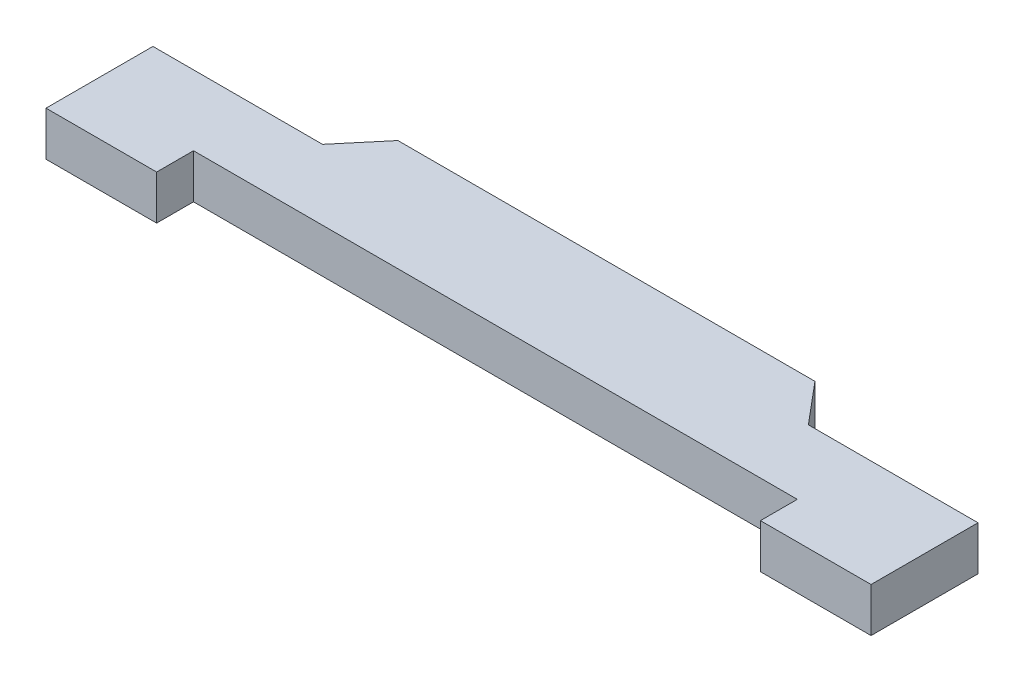
ISO-10303-21;
HEADER;
FILE_DESCRIPTION(('STEP AP214'),'2;1');
FILE_NAME('part.step','',(''),(''),'','','');
FILE_SCHEMA(('AUTOMOTIVE_DESIGN { 1 0 10303 214 1 1 1 1 }'));
ENDSEC;
DATA;
#1=APPLICATION_CONTEXT('core data for automotive mechanical design processes');
#2=APPLICATION_PROTOCOL_DEFINITION('international standard','automotive_design',2000,#1);
#3=PRODUCT_CONTEXT('',#1,'mechanical');
#4=PRODUCT('Part','Part','',(#3));
#5=PRODUCT_RELATED_PRODUCT_CATEGORY('part','',(#4));
#6=PRODUCT_DEFINITION_FORMATION('','',#4);
#7=PRODUCT_DEFINITION_CONTEXT('part definition',#1,'design');
#8=PRODUCT_DEFINITION('design','',#6,#7);
#9=PRODUCT_DEFINITION_SHAPE('','',#8);
#10=(LENGTH_UNIT() NAMED_UNIT(*) SI_UNIT(.MILLI.,.METRE.));
#11=(NAMED_UNIT(*) PLANE_ANGLE_UNIT() SI_UNIT($,.RADIAN.));
#12=(NAMED_UNIT(*) SI_UNIT($,.STERADIAN.) SOLID_ANGLE_UNIT());
#13=UNCERTAINTY_MEASURE_WITH_UNIT(LENGTH_MEASURE(1.E-05),#10,'distance_accuracy_value','');
#14=(GEOMETRIC_REPRESENTATION_CONTEXT(3) GLOBAL_UNCERTAINTY_ASSIGNED_CONTEXT((#13)) GLOBAL_UNIT_ASSIGNED_CONTEXT((#10,
#11,#12)) REPRESENTATION_CONTEXT('',''));
#15=CARTESIAN_POINT('',(0.,0.,0.));
#16=DIRECTION('',(0.,0.,1.));
#17=DIRECTION('',(1.,0.,0.));
#18=AXIS2_PLACEMENT_3D('',#15,#16,#17);
#19=CARTESIAN_POINT('',(-5.655,1.2,-3.01076444252252));
#20=DIRECTION('',(0.766044443118979,0.,0.642787609686538));
#21=DIRECTION('',(0.642787609686538,0.,-0.766044443118979));
#22=AXIS2_PLACEMENT_3D('',#19,#20,#21);
#23=PLANE('',#22);
#24=DIRECTION('',(-0.642787609686538,0.,0.766044443118979));
#25=VECTOR('',#24,1.);
#26=CARTESIAN_POINT('',(-5.655,0.,-3.01076444252252));
#27=LINE('',#26,#25);
#28=CARTESIAN_POINT('',(-5.655,0.,-3.01076444252252));
#29=VERTEX_POINT('',#28);
#30=CARTESIAN_POINT('',(-6.58704203404548,0.,-1.9));
#31=VERTEX_POINT('',#30);
#32=EDGE_CURVE('E155',#29,#31,#27,.T.);
#33=ORIENTED_EDGE('',*,*,#32,.T.);
#34=DIRECTION('',(0.,-1.,0.));
#35=VECTOR('',#34,1.);
#36=CARTESIAN_POINT('',(-6.58704203404548,1.2,-1.9));
#37=LINE('',#36,#35);
#38=CARTESIAN_POINT('',(-6.58704203404548,1.2,-1.9));
#39=VERTEX_POINT('',#38);
#40=EDGE_CURVE('E11',#39,#31,#37,.T.);
#41=ORIENTED_EDGE('',*,*,#40,.F.);
#42=DIRECTION('',(-0.642787609686538,0.,0.766044443118979));
#43=VECTOR('',#42,1.);
#44=CARTESIAN_POINT('',(-5.655,1.2,-3.01076444252252));
#45=LINE('',#44,#43);
#46=CARTESIAN_POINT('',(-5.655,1.2,-3.01076444252252));
#47=VERTEX_POINT('',#46);
#48=EDGE_CURVE('E177',#47,#39,#45,.T.);
#49=ORIENTED_EDGE('',*,*,#48,.F.);
#50=DIRECTION('',(0.,-1.,0.));
#51=VECTOR('',#50,1.);
#52=CARTESIAN_POINT('',(-5.655,1.2,-3.01076444252252));
#53=LINE('',#52,#51);
#54=EDGE_CURVE('E151',#47,#29,#53,.T.);
#55=ORIENTED_EDGE('',*,*,#54,.T.);
#56=EDGE_LOOP('',(#33,#41,#49,#55));
#57=FACE_BOUND('',#56,.T.);
#58=ADVANCED_FACE('F35',(#57),#23,.F.);
#59=CARTESIAN_POINT('',(-6.58704203404548,1.2,-1.9));
#60=DIRECTION('',(0.,0.,1.));
#61=DIRECTION('',(1.,0.,0.));
#62=AXIS2_PLACEMENT_3D('',#59,#60,#61);
#63=PLANE('',#62);
#64=DIRECTION('',(-1.,0.,0.));
#65=VECTOR('',#64,1.);
#66=CARTESIAN_POINT('',(-6.58704203404548,0.,-1.9));
#67=LINE('',#66,#65);
#68=CARTESIAN_POINT('',(-11.1870420340455,0.,-1.9));
#69=VERTEX_POINT('',#68);
#70=EDGE_CURVE('E158',#31,#69,#67,.T.);
#71=ORIENTED_EDGE('',*,*,#70,.T.);
#72=DIRECTION('',(0.,-1.,0.));
#73=VECTOR('',#72,1.);
#74=CARTESIAN_POINT('',(-11.1870420340455,1.2,-1.9));
#75=LINE('',#74,#73);
#76=CARTESIAN_POINT('',(-11.1870420340455,1.2,-1.9));
#77=VERTEX_POINT('',#76);
#78=EDGE_CURVE('E43',#77,#69,#75,.T.);
#79=ORIENTED_EDGE('',*,*,#78,.F.);
#80=DIRECTION('',(-1.,0.,0.));
#81=VECTOR('',#80,1.);
#82=CARTESIAN_POINT('',(-6.58704203404548,1.2,-1.9));
#83=LINE('',#82,#81);
#84=EDGE_CURVE('E106',#39,#77,#83,.T.);
#85=ORIENTED_EDGE('',*,*,#84,.F.);
#86=ORIENTED_EDGE('',*,*,#40,.T.);
#87=EDGE_LOOP('',(#71,#79,#85,#86));
#88=FACE_BOUND('',#87,.T.);
#89=ADVANCED_FACE('F255',(#88),#63,.F.);
#90=CARTESIAN_POINT('',(-11.1870420340455,1.2,-1.9));
#91=DIRECTION('',(1.,0.,0.));
#92=DIRECTION('',(0.,0.,-1.));
#93=AXIS2_PLACEMENT_3D('',#90,#91,#92);
#94=PLANE('',#93);
#95=DIRECTION('',(0.,0.,1.));
#96=VECTOR('',#95,1.);
#97=CARTESIAN_POINT('',(-11.1870420340455,0.,-1.9));
#98=LINE('',#97,#96);
#99=CARTESIAN_POINT('',(-11.1870420340455,0.,1.));
#100=VERTEX_POINT('',#99);
#101=EDGE_CURVE('E160',#69,#100,#98,.T.);
#102=ORIENTED_EDGE('',*,*,#101,.T.);
#103=DIRECTION('',(0.,-1.,0.));
#104=VECTOR('',#103,1.);
#105=CARTESIAN_POINT('',(-11.1870420340455,1.2,1.));
#106=LINE('',#105,#104);
#107=CARTESIAN_POINT('',(-11.1870420340455,1.2,1.));
#108=VERTEX_POINT('',#107);
#109=EDGE_CURVE('E196',#108,#100,#106,.T.);
#110=ORIENTED_EDGE('',*,*,#109,.F.);
#111=DIRECTION('',(0.,0.,1.));
#112=VECTOR('',#111,1.);
#113=CARTESIAN_POINT('',(-11.1870420340455,1.2,-1.9));
#114=LINE('',#113,#112);
#115=EDGE_CURVE('E204',#77,#108,#114,.T.);
#116=ORIENTED_EDGE('',*,*,#115,.F.);
#117=ORIENTED_EDGE('',*,*,#78,.T.);
#118=EDGE_LOOP('',(#102,#110,#116,#117));
#119=FACE_BOUND('',#118,.T.);
#120=ADVANCED_FACE('F202',(#119),#94,.F.);
#121=CARTESIAN_POINT('',(-11.1870420340455,1.2,1.));
#122=DIRECTION('',(0.,0.,-1.));
#123=DIRECTION('',(-1.,0.,0.));
#124=AXIS2_PLACEMENT_3D('',#121,#122,#123);
#125=PLANE('',#124);
#126=DIRECTION('',(1.,0.,0.));
#127=VECTOR('',#126,1.);
#128=CARTESIAN_POINT('',(-11.1870420340455,0.,1.));
#129=LINE('',#128,#127);
#130=CARTESIAN_POINT('',(-8.18704203404548,0.,1.));
#131=VERTEX_POINT('',#130);
#132=EDGE_CURVE('E162',#100,#131,#129,.T.);
#133=ORIENTED_EDGE('',*,*,#132,.T.);
#134=DIRECTION('',(0.,-1.,0.));
#135=VECTOR('',#134,1.);
#136=CARTESIAN_POINT('',(-8.18704203404548,1.2,1.));
#137=LINE('',#136,#135);
#138=CARTESIAN_POINT('',(-8.18704203404548,1.2,1.));
#139=VERTEX_POINT('',#138);
#140=EDGE_CURVE('E193',#139,#131,#137,.T.);
#141=ORIENTED_EDGE('',*,*,#140,.F.);
#142=DIRECTION('',(1.,0.,0.));
#143=VECTOR('',#142,1.);
#144=CARTESIAN_POINT('',(-11.1870420340455,1.2,1.));
#145=LINE('',#144,#143);
#146=EDGE_CURVE('E222',#108,#139,#145,.T.);
#147=ORIENTED_EDGE('',*,*,#146,.F.);
#148=ORIENTED_EDGE('',*,*,#109,.T.);
#149=EDGE_LOOP('',(#133,#141,#147,#148));
#150=FACE_BOUND('',#149,.T.);
#151=ADVANCED_FACE('F213',(#150),#125,.F.);
#152=CARTESIAN_POINT('',(-8.18704203404548,1.2,1.));
#153=DIRECTION('',(-1.,0.,0.));
#154=DIRECTION('',(0.,0.,1.));
#155=AXIS2_PLACEMENT_3D('',#152,#153,#154);
#156=PLANE('',#155);
#157=DIRECTION('',(0.,0.,-1.));
#158=VECTOR('',#157,1.);
#159=CARTESIAN_POINT('',(-8.18704203404548,0.,1.));
#160=LINE('',#159,#158);
#161=CARTESIAN_POINT('',(-8.18704203404548,0.,0.));
#162=VERTEX_POINT('',#161);
#163=EDGE_CURVE('E164',#131,#162,#160,.T.);
#164=ORIENTED_EDGE('',*,*,#163,.T.);
#165=DIRECTION('',(0.,-1.,0.));
#166=VECTOR('',#165,1.);
#167=CARTESIAN_POINT('',(-8.18704203404548,1.2,0.));
#168=LINE('',#167,#166);
#169=CARTESIAN_POINT('',(-8.18704203404548,1.2,0.));
#170=VERTEX_POINT('',#169);
#171=EDGE_CURVE('E190',#170,#162,#168,.T.);
#172=ORIENTED_EDGE('',*,*,#171,.F.);
#173=DIRECTION('',(0.,0.,-1.));
#174=VECTOR('',#173,1.);
#175=CARTESIAN_POINT('',(-8.18704203404548,1.2,1.));
#176=LINE('',#175,#174);
#177=EDGE_CURVE('E219',#139,#170,#176,.T.);
#178=ORIENTED_EDGE('',*,*,#177,.F.);
#179=ORIENTED_EDGE('',*,*,#140,.T.);
#180=EDGE_LOOP('',(#164,#172,#178,#179));
#181=FACE_BOUND('',#180,.T.);
#182=ADVANCED_FACE('F217',(#181),#156,.F.);
#183=CARTESIAN_POINT('',(-8.18704203404548,1.2,0.));
#184=DIRECTION('',(0.,0.,-1.));
#185=DIRECTION('',(-1.,0.,0.));
#186=AXIS2_PLACEMENT_3D('',#183,#184,#185);
#187=PLANE('',#186);
#188=DIRECTION('',(1.,0.,0.));
#189=VECTOR('',#188,1.);
#190=CARTESIAN_POINT('',(-8.18704203404548,0.,0.));
#191=LINE('',#190,#189);
#192=CARTESIAN_POINT('',(8.18704203404548,0.,0.));
#193=VERTEX_POINT('',#192);
#194=EDGE_CURVE('E166',#162,#193,#191,.T.);
#195=ORIENTED_EDGE('',*,*,#194,.T.);
#196=DIRECTION('',(0.,-1.,0.));
#197=VECTOR('',#196,1.);
#198=CARTESIAN_POINT('',(8.18704203404548,1.2,0.));
#199=LINE('',#198,#197);
#200=CARTESIAN_POINT('',(8.18704203404548,1.2,0.));
#201=VERTEX_POINT('',#200);
#202=EDGE_CURVE('E187',#201,#193,#199,.T.);
#203=ORIENTED_EDGE('',*,*,#202,.F.);
#204=DIRECTION('',(1.,0.,0.));
#205=VECTOR('',#204,1.);
#206=CARTESIAN_POINT('',(-8.18704203404548,1.2,0.));
#207=LINE('',#206,#205);
#208=EDGE_CURVE('E221',#170,#201,#207,.T.);
#209=ORIENTED_EDGE('',*,*,#208,.F.);
#210=ORIENTED_EDGE('',*,*,#171,.T.);
#211=EDGE_LOOP('',(#195,#203,#209,#210));
#212=FACE_BOUND('',#211,.T.);
#213=ADVANCED_FACE('F268',(#212),#187,.F.);
#214=CARTESIAN_POINT('',(8.18704203404548,1.2,1.));
#215=DIRECTION('',(1.,0.,0.));
#216=DIRECTION('',(0.,0.,-1.));
#217=AXIS2_PLACEMENT_3D('',#214,#215,#216);
#218=PLANE('',#217);
#219=DIRECTION('',(0.,0.,1.));
#220=VECTOR('',#219,1.);
#221=CARTESIAN_POINT('',(8.18704203404548,0.,1.));
#222=LINE('',#221,#220);
#223=CARTESIAN_POINT('',(8.18704203404548,0.,1.));
#224=VERTEX_POINT('',#223);
#225=EDGE_CURVE('E168',#193,#224,#222,.T.);
#226=ORIENTED_EDGE('',*,*,#225,.T.);
#227=DIRECTION('',(0.,-1.,0.));
#228=VECTOR('',#227,1.);
#229=CARTESIAN_POINT('',(8.18704203404548,1.2,1.));
#230=LINE('',#229,#228);
#231=CARTESIAN_POINT('',(8.18704203404548,1.2,1.));
#232=VERTEX_POINT('',#231);
#233=EDGE_CURVE('E184',#232,#224,#230,.T.);
#234=ORIENTED_EDGE('',*,*,#233,.F.);
#235=DIRECTION('',(0.,0.,1.));
#236=VECTOR('',#235,1.);
#237=CARTESIAN_POINT('',(8.18704203404548,1.2,1.));
#238=LINE('',#237,#236);
#239=EDGE_CURVE('E224',#201,#232,#238,.T.);
#240=ORIENTED_EDGE('',*,*,#239,.F.);
#241=ORIENTED_EDGE('',*,*,#202,.T.);
#242=EDGE_LOOP('',(#226,#234,#240,#241));
#243=FACE_BOUND('',#242,.T.);
#244=ADVANCED_FACE('F271',(#243),#218,.F.);
#245=CARTESIAN_POINT('',(11.1870420340455,1.2,1.));
#246=DIRECTION('',(0.,0.,-1.));
#247=DIRECTION('',(-1.,0.,0.));
#248=AXIS2_PLACEMENT_3D('',#245,#246,#247);
#249=PLANE('',#248);
#250=DIRECTION('',(1.,0.,0.));
#251=VECTOR('',#250,1.);
#252=CARTESIAN_POINT('',(11.1870420340455,0.,1.));
#253=LINE('',#252,#251);
#254=CARTESIAN_POINT('',(11.1870420340455,0.,1.));
#255=VERTEX_POINT('',#254);
#256=EDGE_CURVE('E170',#224,#255,#253,.T.);
#257=ORIENTED_EDGE('',*,*,#256,.T.);
#258=DIRECTION('',(0.,-1.,0.));
#259=VECTOR('',#258,1.);
#260=CARTESIAN_POINT('',(11.1870420340455,1.2,1.));
#261=LINE('',#260,#259);
#262=CARTESIAN_POINT('',(11.1870420340455,1.2,1.));
#263=VERTEX_POINT('',#262);
#264=EDGE_CURVE('E181',#263,#255,#261,.T.);
#265=ORIENTED_EDGE('',*,*,#264,.F.);
#266=DIRECTION('',(1.,0.,0.));
#267=VECTOR('',#266,1.);
#268=CARTESIAN_POINT('',(11.1870420340455,1.2,1.));
#269=LINE('',#268,#267);
#270=EDGE_CURVE('E230',#232,#263,#269,.T.);
#271=ORIENTED_EDGE('',*,*,#270,.F.);
#272=ORIENTED_EDGE('',*,*,#233,.T.);
#273=EDGE_LOOP('',(#257,#265,#271,#272));
#274=FACE_BOUND('',#273,.T.);
#275=ADVANCED_FACE('F236',(#274),#249,.F.);
#276=CARTESIAN_POINT('',(11.1870420340455,1.2,-1.9));
#277=DIRECTION('',(-1.,0.,0.));
#278=DIRECTION('',(0.,0.,1.));
#279=AXIS2_PLACEMENT_3D('',#276,#277,#278);
#280=PLANE('',#279);
#281=DIRECTION('',(0.,0.,-1.));
#282=VECTOR('',#281,1.);
#283=CARTESIAN_POINT('',(11.1870420340455,0.,-1.9));
#284=LINE('',#283,#282);
#285=CARTESIAN_POINT('',(11.1870420340455,0.,-1.9));
#286=VERTEX_POINT('',#285);
#287=EDGE_CURVE('E172',#255,#286,#284,.T.);
#288=ORIENTED_EDGE('',*,*,#287,.T.);
#289=DIRECTION('',(0.,-1.,0.));
#290=VECTOR('',#289,1.);
#291=CARTESIAN_POINT('',(11.1870420340455,1.2,-1.9));
#292=LINE('',#291,#290);
#293=CARTESIAN_POINT('',(11.1870420340455,1.2,-1.9));
#294=VERTEX_POINT('',#293);
#295=EDGE_CURVE('E146',#294,#286,#292,.T.);
#296=ORIENTED_EDGE('',*,*,#295,.F.);
#297=DIRECTION('',(0.,0.,-1.));
#298=VECTOR('',#297,1.);
#299=CARTESIAN_POINT('',(11.1870420340455,1.2,-1.9));
#300=LINE('',#299,#298);
#301=EDGE_CURVE('E137',#263,#294,#300,.T.);
#302=ORIENTED_EDGE('',*,*,#301,.F.);
#303=ORIENTED_EDGE('',*,*,#264,.T.);
#304=EDGE_LOOP('',(#288,#296,#302,#303));
#305=FACE_BOUND('',#304,.T.);
#306=ADVANCED_FACE('F240',(#305),#280,.F.);
#307=CARTESIAN_POINT('',(6.58704203404548,1.2,-1.9));
#308=DIRECTION('',(0.,0.,1.));
#309=DIRECTION('',(1.,0.,0.));
#310=AXIS2_PLACEMENT_3D('',#307,#308,#309);
#311=PLANE('',#310);
#312=DIRECTION('',(-1.,0.,0.));
#313=VECTOR('',#312,1.);
#314=CARTESIAN_POINT('',(6.58704203404548,0.,-1.9));
#315=LINE('',#314,#313);
#316=CARTESIAN_POINT('',(6.58704203404548,0.,-1.9));
#317=VERTEX_POINT('',#316);
#318=EDGE_CURVE('E145',#286,#317,#315,.T.);
#319=ORIENTED_EDGE('',*,*,#318,.T.);
#320=DIRECTION('',(0.,-1.,0.));
#321=VECTOR('',#320,1.);
#322=CARTESIAN_POINT('',(6.58704203404548,1.2,-1.9));
#323=LINE('',#322,#321);
#324=CARTESIAN_POINT('',(6.58704203404548,1.2,-1.9));
#325=VERTEX_POINT('',#324);
#326=EDGE_CURVE('E142',#325,#317,#323,.T.);
#327=ORIENTED_EDGE('',*,*,#326,.F.);
#328=DIRECTION('',(-1.,0.,0.));
#329=VECTOR('',#328,1.);
#330=CARTESIAN_POINT('',(6.58704203404548,1.2,-1.9));
#331=LINE('',#330,#329);
#332=EDGE_CURVE('E131',#294,#325,#331,.T.);
#333=ORIENTED_EDGE('',*,*,#332,.F.);
#334=ORIENTED_EDGE('',*,*,#295,.T.);
#335=EDGE_LOOP('',(#319,#327,#333,#334));
#336=FACE_BOUND('',#335,.T.);
#337=ADVANCED_FACE('F143',(#336),#311,.F.);
#338=CARTESIAN_POINT('',(5.655,1.2,-3.01076444252252));
#339=DIRECTION('',(-0.766044443118979,0.,0.642787609686538));
#340=DIRECTION('',(0.642787609686538,0.,0.766044443118979));
#341=AXIS2_PLACEMENT_3D('',#338,#339,#340);
#342=PLANE('',#341);
#343=DIRECTION('',(-0.642787609686538,0.,-0.766044443118979));
#344=VECTOR('',#343,1.);
#345=CARTESIAN_POINT('',(5.655,0.,-3.01076444252252));
#346=LINE('',#345,#344);
#347=CARTESIAN_POINT('',(5.655,0.,-3.01076444252252));
#348=VERTEX_POINT('',#347);
#349=EDGE_CURVE('E92',#317,#348,#346,.T.);
#350=ORIENTED_EDGE('',*,*,#349,.T.);
#351=DIRECTION('',(0.,-1.,0.));
#352=VECTOR('',#351,1.);
#353=CARTESIAN_POINT('',(5.655,1.2,-3.01076444252252));
#354=LINE('',#353,#352);
#355=CARTESIAN_POINT('',(5.655,1.2,-3.01076444252252));
#356=VERTEX_POINT('',#355);
#357=EDGE_CURVE('E147',#356,#348,#354,.T.);
#358=ORIENTED_EDGE('',*,*,#357,.F.);
#359=DIRECTION('',(-0.642787609686538,0.,-0.766044443118979));
#360=VECTOR('',#359,1.);
#361=CARTESIAN_POINT('',(5.655,1.2,-3.01076444252252));
#362=LINE('',#361,#360);
#363=EDGE_CURVE('E135',#325,#356,#362,.T.);
#364=ORIENTED_EDGE('',*,*,#363,.F.);
#365=ORIENTED_EDGE('',*,*,#326,.T.);
#366=EDGE_LOOP('',(#350,#358,#364,#365));
#367=FACE_BOUND('',#366,.T.);
#368=ADVANCED_FACE('F149',(#367),#342,.F.);
#369=CARTESIAN_POINT('',(5.655,1.2,-3.01076444252252));
#370=DIRECTION('',(0.,0.,1.));
#371=DIRECTION('',(1.,0.,0.));
#372=AXIS2_PLACEMENT_3D('',#369,#370,#371);
#373=PLANE('',#372);
#374=DIRECTION('',(-1.,0.,0.));
#375=VECTOR('',#374,1.);
#376=CARTESIAN_POINT('',(5.655,0.,-3.01076444252252));
#377=LINE('',#376,#375);
#378=EDGE_CURVE('E98',#348,#29,#377,.T.);
#379=ORIENTED_EDGE('',*,*,#378,.T.);
#380=ORIENTED_EDGE('',*,*,#54,.F.);
#381=DIRECTION('',(-1.,0.,0.));
#382=VECTOR('',#381,1.);
#383=CARTESIAN_POINT('',(5.655,1.2,-3.01076444252252));
#384=LINE('',#383,#382);
#385=EDGE_CURVE('E51',#356,#47,#384,.T.);
#386=ORIENTED_EDGE('',*,*,#385,.F.);
#387=ORIENTED_EDGE('',*,*,#357,.T.);
#388=EDGE_LOOP('',(#379,#380,#386,#387));
#389=FACE_BOUND('',#388,.T.);
#390=ADVANCED_FACE('F244',(#389),#373,.F.);
#391=CARTESIAN_POINT('',(0.,1.2,0.));
#392=DIRECTION('',(0.,1.,0.));
#393=DIRECTION('',(0.,0.,1.));
#394=AXIS2_PLACEMENT_3D('',#391,#392,#393);
#395=PLANE('',#394);
#396=ORIENTED_EDGE('',*,*,#48,.T.);
#397=ORIENTED_EDGE('',*,*,#84,.T.);
#398=ORIENTED_EDGE('',*,*,#115,.T.);
#399=ORIENTED_EDGE('',*,*,#146,.T.);
#400=ORIENTED_EDGE('',*,*,#177,.T.);
#401=ORIENTED_EDGE('',*,*,#208,.T.);
#402=ORIENTED_EDGE('',*,*,#239,.T.);
#403=ORIENTED_EDGE('',*,*,#270,.T.);
#404=ORIENTED_EDGE('',*,*,#301,.T.);
#405=ORIENTED_EDGE('',*,*,#332,.T.);
#406=ORIENTED_EDGE('',*,*,#363,.T.);
#407=ORIENTED_EDGE('',*,*,#385,.T.);
#408=EDGE_LOOP('',(#396,#397,#398,#399,#400,#401,#402,#403,#404,#405,#406,#407));
#409=FACE_BOUND('',#408,.T.);
#410=ADVANCED_FACE('F133',(#409),#395,.T.);
#411=CARTESIAN_POINT('',(0.,0.,0.));
#412=DIRECTION('',(0.,1.,0.));
#413=DIRECTION('',(0.,0.,1.));
#414=AXIS2_PLACEMENT_3D('',#411,#412,#413);
#415=PLANE('',#414);
#416=ORIENTED_EDGE('',*,*,#32,.F.);
#417=ORIENTED_EDGE('',*,*,#378,.F.);
#418=ORIENTED_EDGE('',*,*,#349,.F.);
#419=ORIENTED_EDGE('',*,*,#318,.F.);
#420=ORIENTED_EDGE('',*,*,#287,.F.);
#421=ORIENTED_EDGE('',*,*,#256,.F.);
#422=ORIENTED_EDGE('',*,*,#225,.F.);
#423=ORIENTED_EDGE('',*,*,#194,.F.);
#424=ORIENTED_EDGE('',*,*,#163,.F.);
#425=ORIENTED_EDGE('',*,*,#132,.F.);
#426=ORIENTED_EDGE('',*,*,#101,.F.);
#427=ORIENTED_EDGE('',*,*,#70,.F.);
#428=EDGE_LOOP('',(#416,#417,#418,#419,#420,#421,#422,#423,#424,#425,#426,#427));
#429=FACE_BOUND('',#428,.T.);
#430=ADVANCED_FACE('F208',(#429),#415,.F.);
#431=CLOSED_SHELL('',(#58,#89,#120,#151,#182,#213,#244,#275,#306,#337,#368,#390,#410,#430));
#432=MANIFOLD_SOLID_BREP('B2',#431);
#433=ADVANCED_BREP_SHAPE_REPRESENTATION('',(#18,#432),#14);
#434=SHAPE_DEFINITION_REPRESENTATION(#9,#433);
ENDSEC;
END-ISO-10303-21;
